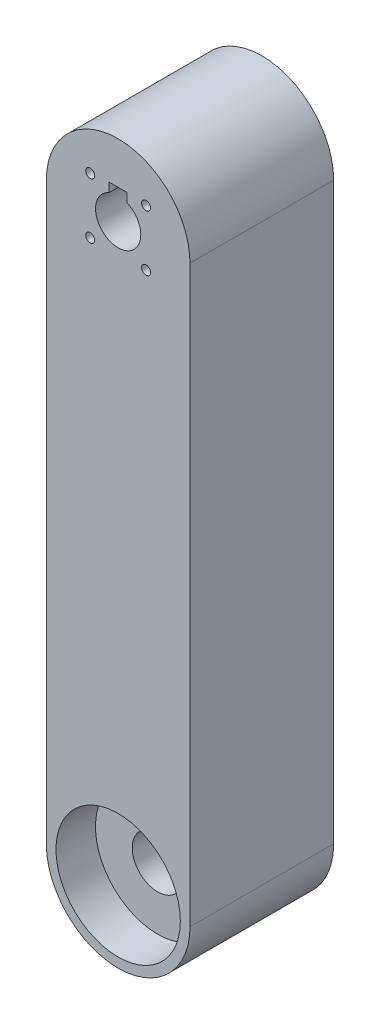
ISO-10303-21;
HEADER;
FILE_DESCRIPTION(('STEP AP214'),'2;1');
FILE_NAME('part.step','',(''),(''),'','','');
FILE_SCHEMA(('AUTOMOTIVE_DESIGN { 1 0 10303 214 1 1 1 1 }'));
ENDSEC;
DATA;
#1=APPLICATION_CONTEXT('core data for automotive mechanical design processes');
#2=APPLICATION_PROTOCOL_DEFINITION('international standard','automotive_design',2000,#1);
#3=PRODUCT_CONTEXT('',#1,'mechanical');
#4=PRODUCT('Part','Part','',(#3));
#5=PRODUCT_RELATED_PRODUCT_CATEGORY('part','',(#4));
#6=PRODUCT_DEFINITION_FORMATION('','',#4);
#7=PRODUCT_DEFINITION_CONTEXT('part definition',#1,'design');
#8=PRODUCT_DEFINITION('design','',#6,#7);
#9=PRODUCT_DEFINITION_SHAPE('','',#8);
#10=(LENGTH_UNIT() NAMED_UNIT(*) SI_UNIT(.MILLI.,.METRE.));
#11=(NAMED_UNIT(*) PLANE_ANGLE_UNIT() SI_UNIT($,.RADIAN.));
#12=(NAMED_UNIT(*) SI_UNIT($,.STERADIAN.) SOLID_ANGLE_UNIT());
#13=UNCERTAINTY_MEASURE_WITH_UNIT(LENGTH_MEASURE(1.E-05),#10,'distance_accuracy_value','');
#14=(GEOMETRIC_REPRESENTATION_CONTEXT(3) GLOBAL_UNCERTAINTY_ASSIGNED_CONTEXT((#13)) GLOBAL_UNIT_ASSIGNED_CONTEXT((#10,
#11,#12)) REPRESENTATION_CONTEXT('',''));
#15=CARTESIAN_POINT('',(0.,0.,0.));
#16=DIRECTION('',(0.,0.,1.));
#17=DIRECTION('',(1.,0.,0.));
#18=AXIS2_PLACEMENT_3D('',#15,#16,#17);
#19=CARTESIAN_POINT('',(0.,-50.8,25.4));
#20=DIRECTION('',(0.,0.,-1.));
#21=DIRECTION('',(-1.,0.,0.));
#22=AXIS2_PLACEMENT_3D('',#19,#20,#21);
#23=CYLINDRICAL_SURFACE('',#22,12.7);
#24=CARTESIAN_POINT('',(0.,-50.8,0.));
#25=DIRECTION('',(0.,0.,1.));
#26=DIRECTION('',(1.,0.,0.));
#27=AXIS2_PLACEMENT_3D('',#24,#25,#26);
#28=CIRCLE('',#27,12.7);
#29=CARTESIAN_POINT('',(-12.7,-50.8,0.));
#30=VERTEX_POINT('',#29);
#31=CARTESIAN_POINT('',(12.7,-50.8,0.));
#32=VERTEX_POINT('',#31);
#33=EDGE_CURVE('E128',#30,#32,#28,.T.);
#34=ORIENTED_EDGE('',*,*,#33,.T.);
#35=DIRECTION('',(0.,0.,-1.));
#36=VECTOR('',#35,1.);
#37=CARTESIAN_POINT('',(12.7,-50.8,25.4));
#38=LINE('',#37,#36);
#39=CARTESIAN_POINT('',(12.7,-50.8,25.4));
#40=VERTEX_POINT('',#39);
#41=EDGE_CURVE('E11',#40,#32,#38,.T.);
#42=ORIENTED_EDGE('',*,*,#41,.F.);
#43=CARTESIAN_POINT('',(0.,-50.8,25.4));
#44=DIRECTION('',(0.,0.,1.));
#45=DIRECTION('',(1.,0.,0.));
#46=AXIS2_PLACEMENT_3D('',#43,#44,#45);
#47=CIRCLE('',#46,12.7);
#48=CARTESIAN_POINT('',(-12.7,-50.8,25.4));
#49=VERTEX_POINT('',#48);
#50=EDGE_CURVE('E138',#49,#40,#47,.T.);
#51=ORIENTED_EDGE('',*,*,#50,.F.);
#52=DIRECTION('',(0.,0.,-1.));
#53=VECTOR('',#52,1.);
#54=CARTESIAN_POINT('',(-12.7,-50.8,25.4));
#55=LINE('',#54,#53);
#56=EDGE_CURVE('E143',#49,#30,#55,.T.);
#57=ORIENTED_EDGE('',*,*,#56,.T.);
#58=EDGE_LOOP('',(#34,#42,#51,#57));
#59=FACE_BOUND('',#58,.T.);
#60=ADVANCED_FACE('F32',(#59),#23,.T.);
#61=CARTESIAN_POINT('',(12.7,50.8,25.4));
#62=DIRECTION('',(-1.,0.,0.));
#63=DIRECTION('',(0.,-1.,0.));
#64=AXIS2_PLACEMENT_3D('',#61,#62,#63);
#65=PLANE('',#64);
#66=DIRECTION('',(0.,1.,0.));
#67=VECTOR('',#66,1.);
#68=CARTESIAN_POINT('',(12.7,50.8,0.));
#69=LINE('',#68,#67);
#70=CARTESIAN_POINT('',(12.7,50.8,0.));
#71=VERTEX_POINT('',#70);
#72=EDGE_CURVE('E132',#32,#71,#69,.T.);
#73=ORIENTED_EDGE('',*,*,#72,.T.);
#74=DIRECTION('',(0.,0.,-1.));
#75=VECTOR('',#74,1.);
#76=CARTESIAN_POINT('',(12.7,50.8,25.4));
#77=LINE('',#76,#75);
#78=CARTESIAN_POINT('',(12.7,50.8,25.4));
#79=VERTEX_POINT('',#78);
#80=EDGE_CURVE('E40',#79,#71,#77,.T.);
#81=ORIENTED_EDGE('',*,*,#80,.F.);
#82=DIRECTION('',(0.,1.,0.));
#83=VECTOR('',#82,1.);
#84=CARTESIAN_POINT('',(12.7,50.8,25.4));
#85=LINE('',#84,#83);
#86=EDGE_CURVE('E84',#40,#79,#85,.T.);
#87=ORIENTED_EDGE('',*,*,#86,.F.);
#88=ORIENTED_EDGE('',*,*,#41,.T.);
#89=EDGE_LOOP('',(#73,#81,#87,#88));
#90=FACE_BOUND('',#89,.T.);
#91=ADVANCED_FACE('F172',(#90),#65,.F.);
#92=CARTESIAN_POINT('',(0.,50.8,25.4));
#93=DIRECTION('',(0.,0.,-1.));
#94=DIRECTION('',(-1.,0.,0.));
#95=AXIS2_PLACEMENT_3D('',#92,#93,#94);
#96=CYLINDRICAL_SURFACE('',#95,12.7);
#97=CARTESIAN_POINT('',(0.,50.8,0.));
#98=DIRECTION('',(0.,0.,1.));
#99=DIRECTION('',(-1.,0.,0.));
#100=AXIS2_PLACEMENT_3D('',#97,#98,#99);
#101=CIRCLE('',#100,12.7);
#102=CARTESIAN_POINT('',(-12.7,50.8,0.));
#103=VERTEX_POINT('',#102);
#104=EDGE_CURVE('E146',#71,#103,#101,.T.);
#105=ORIENTED_EDGE('',*,*,#104,.T.);
#106=DIRECTION('',(0.,0.,-1.));
#107=VECTOR('',#106,1.);
#108=CARTESIAN_POINT('',(-12.7,50.8,25.4));
#109=LINE('',#108,#107);
#110=CARTESIAN_POINT('',(-12.7,50.8,25.4));
#111=VERTEX_POINT('',#110);
#112=EDGE_CURVE('E150',#111,#103,#109,.T.);
#113=ORIENTED_EDGE('',*,*,#112,.F.);
#114=CARTESIAN_POINT('',(0.,50.8,25.4));
#115=DIRECTION('',(0.,0.,1.));
#116=DIRECTION('',(-1.,0.,0.));
#117=AXIS2_PLACEMENT_3D('',#114,#115,#116);
#118=CIRCLE('',#117,12.7);
#119=EDGE_CURVE('E141',#79,#111,#118,.T.);
#120=ORIENTED_EDGE('',*,*,#119,.F.);
#121=ORIENTED_EDGE('',*,*,#80,.T.);
#122=EDGE_LOOP('',(#105,#113,#120,#121));
#123=FACE_BOUND('',#122,.T.);
#124=ADVANCED_FACE('F156',(#123),#96,.T.);
#125=CARTESIAN_POINT('',(-12.7,50.8,25.4));
#126=DIRECTION('',(1.,0.,0.));
#127=DIRECTION('',(0.,1.,0.));
#128=AXIS2_PLACEMENT_3D('',#125,#126,#127);
#129=PLANE('',#128);
#130=DIRECTION('',(0.,-1.,0.));
#131=VECTOR('',#130,1.);
#132=CARTESIAN_POINT('',(-12.7,50.8,0.));
#133=LINE('',#132,#131);
#134=EDGE_CURVE('E77',#103,#30,#133,.T.);
#135=ORIENTED_EDGE('',*,*,#134,.T.);
#136=ORIENTED_EDGE('',*,*,#56,.F.);
#137=DIRECTION('',(0.,-1.,0.));
#138=VECTOR('',#137,1.);
#139=CARTESIAN_POINT('',(-12.7,50.8,25.4));
#140=LINE('',#139,#138);
#141=EDGE_CURVE('E56',#111,#49,#140,.T.);
#142=ORIENTED_EDGE('',*,*,#141,.F.);
#143=ORIENTED_EDGE('',*,*,#112,.T.);
#144=EDGE_LOOP('',(#135,#136,#142,#143));
#145=FACE_BOUND('',#144,.T.);
#146=ADVANCED_FACE('F162',(#145),#129,.F.);
#147=CARTESIAN_POINT('',(0.,-50.8,25.4));
#148=DIRECTION('',(0.,0.,1.));
#149=DIRECTION('',(1.,0.,0.));
#150=AXIS2_PLACEMENT_3D('',#147,#148,#149);
#151=PLANE('',#150);
#152=CARTESIAN_POINT('',(0.,-50.8,25.4));
#153=DIRECTION('',(0.,0.,1.));
#154=DIRECTION('',(1.,0.,0.));
#155=AXIS2_PLACEMENT_3D('',#152,#153,#154);
#156=CIRCLE('',#155,10.99185);
#157=CARTESIAN_POINT('',(10.99185,-50.8,25.4));
#158=VERTEX_POINT('',#157);
#159=EDGE_CURVE('E345',#158,#158,#156,.T.);
#160=ORIENTED_EDGE('',*,*,#159,.F.);
#161=EDGE_LOOP('',(#160));
#162=FACE_BOUND('',#161,.T.);
#163=DIRECTION('',(0.,-1.,0.));
#164=VECTOR('',#163,1.);
#165=CARTESIAN_POINT('',(-1.5875,56.0589906713759,25.4));
#166=LINE('',#165,#164);
#167=CARTESIAN_POINT('',(-1.5875,56.0589906713759,25.4));
#168=VERTEX_POINT('',#167);
#169=CARTESIAN_POINT('',(-1.5875,54.4714906713759,25.4));
#170=VERTEX_POINT('',#169);
#171=EDGE_CURVE('E47',#168,#170,#166,.T.);
#172=ORIENTED_EDGE('',*,*,#171,.F.);
#173=DIRECTION('',(-1.,0.,0.));
#174=VECTOR('',#173,1.);
#175=CARTESIAN_POINT('',(-1.5875,56.0589906713759,25.4));
#176=LINE('',#175,#174);
#177=CARTESIAN_POINT('',(1.5875,56.0589906713759,25.4));
#178=VERTEX_POINT('',#177);
#179=EDGE_CURVE('E124',#178,#168,#176,.T.);
#180=ORIENTED_EDGE('',*,*,#179,.F.);
#181=DIRECTION('',(0.,1.,0.));
#182=VECTOR('',#181,1.);
#183=CARTESIAN_POINT('',(1.5875,56.0589906713759,25.4));
#184=LINE('',#183,#182);
#185=CARTESIAN_POINT('',(1.5875,54.4714906713759,25.4));
#186=VERTEX_POINT('',#185);
#187=EDGE_CURVE('E356',#186,#178,#184,.T.);
#188=ORIENTED_EDGE('',*,*,#187,.F.);
#189=CARTESIAN_POINT('',(0.,50.8,25.4));
#190=DIRECTION('',(0.,0.,1.));
#191=DIRECTION('',(1.,0.,0.));
#192=AXIS2_PLACEMENT_3D('',#189,#190,#191);
#193=CIRCLE('',#192,4.);
#194=EDGE_CURVE('E129',#170,#186,#193,.T.);
#195=ORIENTED_EDGE('',*,*,#194,.F.);
#196=EDGE_LOOP('',(#172,#180,#188,#195));
#197=FACE_BOUND('',#196,.T.);
#198=CARTESIAN_POINT('',(4.93914086658801,45.8608591334119,25.4));
#199=DIRECTION('',(0.,0.,1.));
#200=DIRECTION('',(1.,0.,0.));
#201=AXIS2_PLACEMENT_3D('',#198,#199,#200);
#202=CIRCLE('',#201,0.79375);
#203=CARTESIAN_POINT('',(5.73289086658801,45.8608591334119,25.4));
#204=VERTEX_POINT('',#203);
#205=EDGE_CURVE('E363',#204,#204,#202,.T.);
#206=ORIENTED_EDGE('',*,*,#205,.F.);
#207=EDGE_LOOP('',(#206));
#208=FACE_BOUND('',#207,.T.);
#209=CARTESIAN_POINT('',(4.93914086658806,55.739140866588,25.4));
#210=DIRECTION('',(0.,0.,1.));
#211=DIRECTION('',(1.,0.,0.));
#212=AXIS2_PLACEMENT_3D('',#209,#210,#211);
#213=CIRCLE('',#212,0.79375);
#214=CARTESIAN_POINT('',(5.73289086658806,55.739140866588,25.4));
#215=VERTEX_POINT('',#214);
#216=EDGE_CURVE('E379',#215,#215,#213,.T.);
#217=ORIENTED_EDGE('',*,*,#216,.F.);
#218=EDGE_LOOP('',(#217));
#219=FACE_BOUND('',#218,.T.);
#220=CARTESIAN_POINT('',(-4.93914086658805,45.860859133412,25.4));
#221=DIRECTION('',(0.,0.,1.));
#222=DIRECTION('',(1.,0.,0.));
#223=AXIS2_PLACEMENT_3D('',#220,#221,#222);
#224=CIRCLE('',#223,0.793749999999997);
#225=CARTESIAN_POINT('',(-4.14539086658806,45.860859133412,25.4));
#226=VERTEX_POINT('',#225);
#227=EDGE_CURVE('E373',#226,#226,#224,.T.);
#228=ORIENTED_EDGE('',*,*,#227,.F.);
#229=EDGE_LOOP('',(#228));
#230=FACE_BOUND('',#229,.T.);
#231=CARTESIAN_POINT('',(-4.93914086658801,55.7391408665881,25.4));
#232=DIRECTION('',(0.,0.,1.));
#233=DIRECTION('',(1.,0.,0.));
#234=AXIS2_PLACEMENT_3D('',#231,#232,#233);
#235=CIRCLE('',#234,0.793750000000002);
#236=CARTESIAN_POINT('',(-4.14539086658801,55.7391408665881,25.4));
#237=VERTEX_POINT('',#236);
#238=EDGE_CURVE('E367',#237,#237,#235,.T.);
#239=ORIENTED_EDGE('',*,*,#238,.F.);
#240=EDGE_LOOP('',(#239));
#241=FACE_BOUND('',#240,.T.);
#242=ORIENTED_EDGE('',*,*,#50,.T.);
#243=ORIENTED_EDGE('',*,*,#86,.T.);
#244=ORIENTED_EDGE('',*,*,#119,.T.);
#245=ORIENTED_EDGE('',*,*,#141,.T.);
#246=EDGE_LOOP('',(#242,#243,#244,#245));
#247=FACE_BOUND('',#246,.T.);
#248=ADVANCED_FACE('F164',(#162,#197,#208,#219,#230,#241,#247),#151,.T.);
#249=CARTESIAN_POINT('',(0.,-50.8,0.));
#250=DIRECTION('',(0.,0.,1.));
#251=DIRECTION('',(1.,0.,0.));
#252=AXIS2_PLACEMENT_3D('',#249,#250,#251);
#253=PLANE('',#252);
#254=CARTESIAN_POINT('',(0.,-50.8,0.));
#255=DIRECTION('',(0.,0.,1.));
#256=DIRECTION('',(1.,0.,0.));
#257=AXIS2_PLACEMENT_3D('',#254,#255,#256);
#258=CIRCLE('',#257,10.99185);
#259=CARTESIAN_POINT('',(10.99185,-50.8,0.));
#260=VERTEX_POINT('',#259);
#261=EDGE_CURVE('E340',#260,#260,#258,.T.);
#262=ORIENTED_EDGE('',*,*,#261,.T.);
#263=EDGE_LOOP('',(#262));
#264=FACE_BOUND('',#263,.T.);
#265=CARTESIAN_POINT('',(4.93914086658801,45.8608591334119,0.));
#266=DIRECTION('',(0.,0.,1.));
#267=DIRECTION('',(1.,0.,0.));
#268=AXIS2_PLACEMENT_3D('',#265,#266,#267);
#269=CIRCLE('',#268,0.79375);
#270=CARTESIAN_POINT('',(5.73289086658801,45.8608591334119,0.));
#271=VERTEX_POINT('',#270);
#272=EDGE_CURVE('E382',#271,#271,#269,.F.);
#273=ORIENTED_EDGE('',*,*,#272,.F.);
#274=EDGE_LOOP('',(#273));
#275=FACE_BOUND('',#274,.T.);
#276=CARTESIAN_POINT('',(4.93914086658806,55.739140866588,0.));
#277=DIRECTION('',(0.,0.,1.));
#278=DIRECTION('',(1.,0.,0.));
#279=AXIS2_PLACEMENT_3D('',#276,#277,#278);
#280=CIRCLE('',#279,0.79375);
#281=CARTESIAN_POINT('',(5.73289086658806,55.739140866588,0.));
#282=VERTEX_POINT('',#281);
#283=EDGE_CURVE('E376',#282,#282,#280,.F.);
#284=ORIENTED_EDGE('',*,*,#283,.F.);
#285=EDGE_LOOP('',(#284));
#286=FACE_BOUND('',#285,.T.);
#287=CARTESIAN_POINT('',(-4.93914086658805,45.860859133412,0.));
#288=DIRECTION('',(0.,0.,1.));
#289=DIRECTION('',(1.,0.,0.));
#290=AXIS2_PLACEMENT_3D('',#287,#288,#289);
#291=CIRCLE('',#290,0.793749999999997);
#292=CARTESIAN_POINT('',(-4.14539086658806,45.860859133412,0.));
#293=VERTEX_POINT('',#292);
#294=EDGE_CURVE('E370',#293,#293,#291,.F.);
#295=ORIENTED_EDGE('',*,*,#294,.F.);
#296=EDGE_LOOP('',(#295));
#297=FACE_BOUND('',#296,.T.);
#298=CARTESIAN_POINT('',(-4.93914086658801,55.7391408665881,0.));
#299=DIRECTION('',(0.,0.,1.));
#300=DIRECTION('',(1.,0.,0.));
#301=AXIS2_PLACEMENT_3D('',#298,#299,#300);
#302=CIRCLE('',#301,0.793750000000002);
#303=CARTESIAN_POINT('',(-4.14539086658801,55.7391408665881,0.));
#304=VERTEX_POINT('',#303);
#305=EDGE_CURVE('E134',#304,#304,#302,.F.);
#306=ORIENTED_EDGE('',*,*,#305,.F.);
#307=EDGE_LOOP('',(#306));
#308=FACE_BOUND('',#307,.T.);
#309=DIRECTION('',(-1.,0.,0.));
#310=VECTOR('',#309,1.);
#311=CARTESIAN_POINT('',(-1.5875,56.0589906713759,0.));
#312=LINE('',#311,#310);
#313=CARTESIAN_POINT('',(1.5875,56.0589906713759,0.));
#314=VERTEX_POINT('',#313);
#315=CARTESIAN_POINT('',(-1.5875,56.0589906713759,0.));
#316=VERTEX_POINT('',#315);
#317=EDGE_CURVE('E114',#314,#316,#312,.T.);
#318=ORIENTED_EDGE('',*,*,#317,.T.);
#319=DIRECTION('',(0.,-1.,0.));
#320=VECTOR('',#319,1.);
#321=CARTESIAN_POINT('',(-1.5875,56.0589906713759,0.));
#322=LINE('',#321,#320);
#323=CARTESIAN_POINT('',(-1.5875,54.4714906713759,0.));
#324=VERTEX_POINT('',#323);
#325=EDGE_CURVE('E107',#316,#324,#322,.T.);
#326=ORIENTED_EDGE('',*,*,#325,.T.);
#327=CARTESIAN_POINT('',(0.,50.8,0.));
#328=DIRECTION('',(0.,0.,1.));
#329=DIRECTION('',(1.,0.,0.));
#330=AXIS2_PLACEMENT_3D('',#327,#328,#329);
#331=CIRCLE('',#330,4.);
#332=CARTESIAN_POINT('',(1.5875,54.4714906713759,0.));
#333=VERTEX_POINT('',#332);
#334=EDGE_CURVE('E121',#333,#324,#331,.F.);
#335=ORIENTED_EDGE('',*,*,#334,.F.);
#336=DIRECTION('',(0.,1.,0.));
#337=VECTOR('',#336,1.);
#338=CARTESIAN_POINT('',(1.5875,56.0589906713759,0.));
#339=LINE('',#338,#337);
#340=EDGE_CURVE('E123',#333,#314,#339,.T.);
#341=ORIENTED_EDGE('',*,*,#340,.T.);
#342=EDGE_LOOP('',(#318,#326,#335,#341));
#343=FACE_BOUND('',#342,.T.);
#344=ORIENTED_EDGE('',*,*,#33,.F.);
#345=ORIENTED_EDGE('',*,*,#134,.F.);
#346=ORIENTED_EDGE('',*,*,#104,.F.);
#347=ORIENTED_EDGE('',*,*,#72,.F.);
#348=EDGE_LOOP('',(#344,#345,#346,#347));
#349=FACE_BOUND('',#348,.T.);
#350=ADVANCED_FACE('F118',(#264,#275,#286,#297,#308,#343,#349),#253,.F.);
#351=CARTESIAN_POINT('',(0.,50.8,-0.001000000000001));
#352=DIRECTION('',(0.,0.,1.));
#353=DIRECTION('',(1.,0.,0.));
#354=AXIS2_PLACEMENT_3D('',#351,#352,#353);
#355=CYLINDRICAL_SURFACE('',#354,4.);
#356=ORIENTED_EDGE('',*,*,#194,.T.);
#357=DIRECTION('',(0.,0.,1.));
#358=VECTOR('',#357,1.);
#359=CARTESIAN_POINT('',(1.5875,54.4714906713759,0.));
#360=LINE('',#359,#358);
#361=EDGE_CURVE('E113',#333,#186,#360,.T.);
#362=ORIENTED_EDGE('',*,*,#361,.F.);
#363=ORIENTED_EDGE('',*,*,#334,.T.);
#364=DIRECTION('',(0.,0.,1.));
#365=VECTOR('',#364,1.);
#366=CARTESIAN_POINT('',(-1.5875,54.4714906713759,0.));
#367=LINE('',#366,#365);
#368=EDGE_CURVE('E104',#324,#170,#367,.T.);
#369=ORIENTED_EDGE('',*,*,#368,.T.);
#370=EDGE_LOOP('',(#356,#362,#363,#369));
#371=FACE_BOUND('',#370,.T.);
#372=ADVANCED_FACE('F127',(#371),#355,.F.);
#373=CARTESIAN_POINT('',(-4.93914086658801,55.7391408665881,-0.001000000000001));
#374=DIRECTION('',(0.,0.,1.));
#375=DIRECTION('',(1.,0.,0.));
#376=AXIS2_PLACEMENT_3D('',#373,#374,#375);
#377=CYLINDRICAL_SURFACE('',#376,0.793750000000002);
#378=ORIENTED_EDGE('',*,*,#238,.T.);
#379=EDGE_LOOP('',(#378));
#380=FACE_BOUND('',#379,.T.);
#381=ORIENTED_EDGE('',*,*,#305,.T.);
#382=EDGE_LOOP('',(#381));
#383=FACE_BOUND('',#382,.T.);
#384=ADVANCED_FACE('F195',(#380,#383),#377,.F.);
#385=CARTESIAN_POINT('',(-4.93914086658805,45.860859133412,-0.001000000000001));
#386=DIRECTION('',(0.,0.,1.));
#387=DIRECTION('',(1.,0.,0.));
#388=AXIS2_PLACEMENT_3D('',#385,#386,#387);
#389=CYLINDRICAL_SURFACE('',#388,0.793749999999997);
#390=ORIENTED_EDGE('',*,*,#227,.T.);
#391=EDGE_LOOP('',(#390));
#392=FACE_BOUND('',#391,.T.);
#393=ORIENTED_EDGE('',*,*,#294,.T.);
#394=EDGE_LOOP('',(#393));
#395=FACE_BOUND('',#394,.T.);
#396=ADVANCED_FACE('F200',(#392,#395),#389,.F.);
#397=CARTESIAN_POINT('',(4.93914086658806,55.739140866588,-0.001000000000001));
#398=DIRECTION('',(0.,0.,1.));
#399=DIRECTION('',(1.,0.,0.));
#400=AXIS2_PLACEMENT_3D('',#397,#398,#399);
#401=CYLINDRICAL_SURFACE('',#400,0.79375);
#402=ORIENTED_EDGE('',*,*,#216,.T.);
#403=EDGE_LOOP('',(#402));
#404=FACE_BOUND('',#403,.T.);
#405=ORIENTED_EDGE('',*,*,#283,.T.);
#406=EDGE_LOOP('',(#405));
#407=FACE_BOUND('',#406,.T.);
#408=ADVANCED_FACE('F212',(#404,#407),#401,.F.);
#409=CARTESIAN_POINT('',(4.93914086658801,45.8608591334119,-0.001000000000001));
#410=DIRECTION('',(0.,0.,1.));
#411=DIRECTION('',(1.,0.,0.));
#412=AXIS2_PLACEMENT_3D('',#409,#410,#411);
#413=CYLINDRICAL_SURFACE('',#412,0.79375);
#414=ORIENTED_EDGE('',*,*,#205,.T.);
#415=EDGE_LOOP('',(#414));
#416=FACE_BOUND('',#415,.T.);
#417=ORIENTED_EDGE('',*,*,#272,.T.);
#418=EDGE_LOOP('',(#417));
#419=FACE_BOUND('',#418,.T.);
#420=ADVANCED_FACE('F222',(#416,#419),#413,.F.);
#421=CARTESIAN_POINT('',(-1.5875,56.0589906713759,0.));
#422=DIRECTION('',(-1.,0.,0.));
#423=DIRECTION('',(0.,-1.,0.));
#424=AXIS2_PLACEMENT_3D('',#421,#422,#423);
#425=PLANE('',#424);
#426=ORIENTED_EDGE('',*,*,#171,.T.);
#427=ORIENTED_EDGE('',*,*,#368,.F.);
#428=ORIENTED_EDGE('',*,*,#325,.F.);
#429=DIRECTION('',(0.,0.,1.));
#430=VECTOR('',#429,1.);
#431=CARTESIAN_POINT('',(-1.5875,56.0589906713759,0.));
#432=LINE('',#431,#430);
#433=EDGE_CURVE('E361',#316,#168,#432,.T.);
#434=ORIENTED_EDGE('',*,*,#433,.T.);
#435=EDGE_LOOP('',(#426,#427,#428,#434));
#436=FACE_BOUND('',#435,.T.);
#437=ADVANCED_FACE('F106',(#436),#425,.F.);
#438=CARTESIAN_POINT('',(-1.5875,56.0589906713759,0.));
#439=DIRECTION('',(0.,1.,0.));
#440=DIRECTION('',(0.,0.,1.));
#441=AXIS2_PLACEMENT_3D('',#438,#439,#440);
#442=PLANE('',#441);
#443=ORIENTED_EDGE('',*,*,#179,.T.);
#444=ORIENTED_EDGE('',*,*,#433,.F.);
#445=ORIENTED_EDGE('',*,*,#317,.F.);
#446=DIRECTION('',(0.,0.,1.));
#447=VECTOR('',#446,1.);
#448=CARTESIAN_POINT('',(1.5875,56.0589906713759,0.));
#449=LINE('',#448,#447);
#450=EDGE_CURVE('E364',#314,#178,#449,.T.);
#451=ORIENTED_EDGE('',*,*,#450,.T.);
#452=EDGE_LOOP('',(#443,#444,#445,#451));
#453=FACE_BOUND('',#452,.T.);
#454=ADVANCED_FACE('F249',(#453),#442,.F.);
#455=CARTESIAN_POINT('',(1.5875,56.0589906713759,0.));
#456=DIRECTION('',(1.,0.,0.));
#457=DIRECTION('',(0.,1.,0.));
#458=AXIS2_PLACEMENT_3D('',#455,#456,#457);
#459=PLANE('',#458);
#460=ORIENTED_EDGE('',*,*,#187,.T.);
#461=ORIENTED_EDGE('',*,*,#450,.F.);
#462=ORIENTED_EDGE('',*,*,#340,.F.);
#463=ORIENTED_EDGE('',*,*,#361,.T.);
#464=EDGE_LOOP('',(#460,#461,#462,#463));
#465=FACE_BOUND('',#464,.T.);
#466=ADVANCED_FACE('F258',(#465),#459,.F.);
#467=CARTESIAN_POINT('',(0.,-50.8,18.415));
#468=DIRECTION('',(0.,0.,1.));
#469=DIRECTION('',(1.,0.,0.));
#470=AXIS2_PLACEMENT_3D('',#467,#468,#469);
#471=CYLINDRICAL_SURFACE('',#470,10.99185);
#472=CARTESIAN_POINT('',(0.,-50.8,18.415));
#473=DIRECTION('',(0.,0.,1.));
#474=DIRECTION('',(1.,0.,0.));
#475=AXIS2_PLACEMENT_3D('',#472,#473,#474);
#476=CIRCLE('',#475,10.99185);
#477=CARTESIAN_POINT('',(10.99185,-50.8,18.415));
#478=VERTEX_POINT('',#477);
#479=EDGE_CURVE('E348',#478,#478,#476,.T.);
#480=ORIENTED_EDGE('',*,*,#479,.F.);
#481=EDGE_LOOP('',(#480));
#482=FACE_BOUND('',#481,.T.);
#483=ORIENTED_EDGE('',*,*,#159,.T.);
#484=EDGE_LOOP('',(#483));
#485=FACE_BOUND('',#484,.T.);
#486=ADVANCED_FACE('F268',(#482,#485),#471,.F.);
#487=CARTESIAN_POINT('',(0.,-50.8,18.415));
#488=DIRECTION('',(0.,0.,1.));
#489=DIRECTION('',(1.,0.,0.));
#490=AXIS2_PLACEMENT_3D('',#487,#488,#489);
#491=PLANE('',#490);
#492=CARTESIAN_POINT('',(0.,-50.8,18.415));
#493=DIRECTION('',(0.,0.,1.));
#494=DIRECTION('',(1.,0.,0.));
#495=AXIS2_PLACEMENT_3D('',#492,#493,#494);
#496=CIRCLE('',#495,4.5);
#497=CARTESIAN_POINT('',(4.5,-50.8,18.415));
#498=VERTEX_POINT('',#497);
#499=EDGE_CURVE('E338',#498,#498,#496,.T.);
#500=ORIENTED_EDGE('',*,*,#499,.F.);
#501=EDGE_LOOP('',(#500));
#502=FACE_BOUND('',#501,.T.);
#503=ORIENTED_EDGE('',*,*,#479,.T.);
#504=EDGE_LOOP('',(#503));
#505=FACE_BOUND('',#504,.T.);
#506=ADVANCED_FACE('F283',(#502,#505),#491,.T.);
#507=CARTESIAN_POINT('',(0.,-50.8,6.985));
#508=DIRECTION('',(0.,0.,-1.));
#509=DIRECTION('',(-1.,0.,0.));
#510=AXIS2_PLACEMENT_3D('',#507,#508,#509);
#511=CYLINDRICAL_SURFACE('',#510,10.99185);
#512=CARTESIAN_POINT('',(0.,-50.8,6.985));
#513=DIRECTION('',(0.,0.,1.));
#514=DIRECTION('',(1.,0.,0.));
#515=AXIS2_PLACEMENT_3D('',#512,#513,#514);
#516=CIRCLE('',#515,10.99185);
#517=CARTESIAN_POINT('',(10.99185,-50.8,6.985));
#518=VERTEX_POINT('',#517);
#519=EDGE_CURVE('E342',#518,#518,#516,.T.);
#520=ORIENTED_EDGE('',*,*,#519,.T.);
#521=EDGE_LOOP('',(#520));
#522=FACE_BOUND('',#521,.T.);
#523=ORIENTED_EDGE('',*,*,#261,.F.);
#524=EDGE_LOOP('',(#523));
#525=FACE_BOUND('',#524,.T.);
#526=ADVANCED_FACE('F297',(#522,#525),#511,.F.);
#527=CARTESIAN_POINT('',(0.,-50.8,6.985));
#528=DIRECTION('',(0.,0.,-1.));
#529=DIRECTION('',(1.,0.,0.));
#530=AXIS2_PLACEMENT_3D('',#527,#528,#529);
#531=PLANE('',#530);
#532=CARTESIAN_POINT('',(0.,-50.8,6.985));
#533=DIRECTION('',(0.,0.,-1.));
#534=DIRECTION('',(-1.,0.,0.));
#535=AXIS2_PLACEMENT_3D('',#532,#533,#534);
#536=CIRCLE('',#535,4.5);
#537=CARTESIAN_POINT('',(-4.5,-50.8,6.985));
#538=VERTEX_POINT('',#537);
#539=EDGE_CURVE('E35',#538,#538,#536,.T.);
#540=ORIENTED_EDGE('',*,*,#539,.F.);
#541=EDGE_LOOP('',(#540));
#542=FACE_BOUND('',#541,.T.);
#543=ORIENTED_EDGE('',*,*,#519,.F.);
#544=EDGE_LOOP('',(#543));
#545=FACE_BOUND('',#544,.T.);
#546=ADVANCED_FACE('F302',(#542,#545),#531,.T.);
#547=CARTESIAN_POINT('',(0.,-50.8,0.));
#548=DIRECTION('',(0.,0.,1.));
#549=DIRECTION('',(1.,0.,0.));
#550=AXIS2_PLACEMENT_3D('',#547,#548,#549);
#551=CYLINDRICAL_SURFACE('',#550,4.5);
#552=ORIENTED_EDGE('',*,*,#539,.T.);
#553=EDGE_LOOP('',(#552));
#554=FACE_BOUND('',#553,.T.);
#555=ORIENTED_EDGE('',*,*,#499,.T.);
#556=EDGE_LOOP('',(#555));
#557=FACE_BOUND('',#556,.T.);
#558=ADVANCED_FACE('F319',(#554,#557),#551,.F.);
#559=CLOSED_SHELL('',(#60,#91,#124,#146,#248,#350,#372,#384,#396,#408,#420,#437,#454,#466,#486,
#506,#526,#546,#558));
#560=MANIFOLD_SOLID_BREP('B2',#559);
#561=ADVANCED_BREP_SHAPE_REPRESENTATION('',(#18,#560),#14);
#562=SHAPE_DEFINITION_REPRESENTATION(#9,#561);
ENDSEC;
END-ISO-10303-21;
